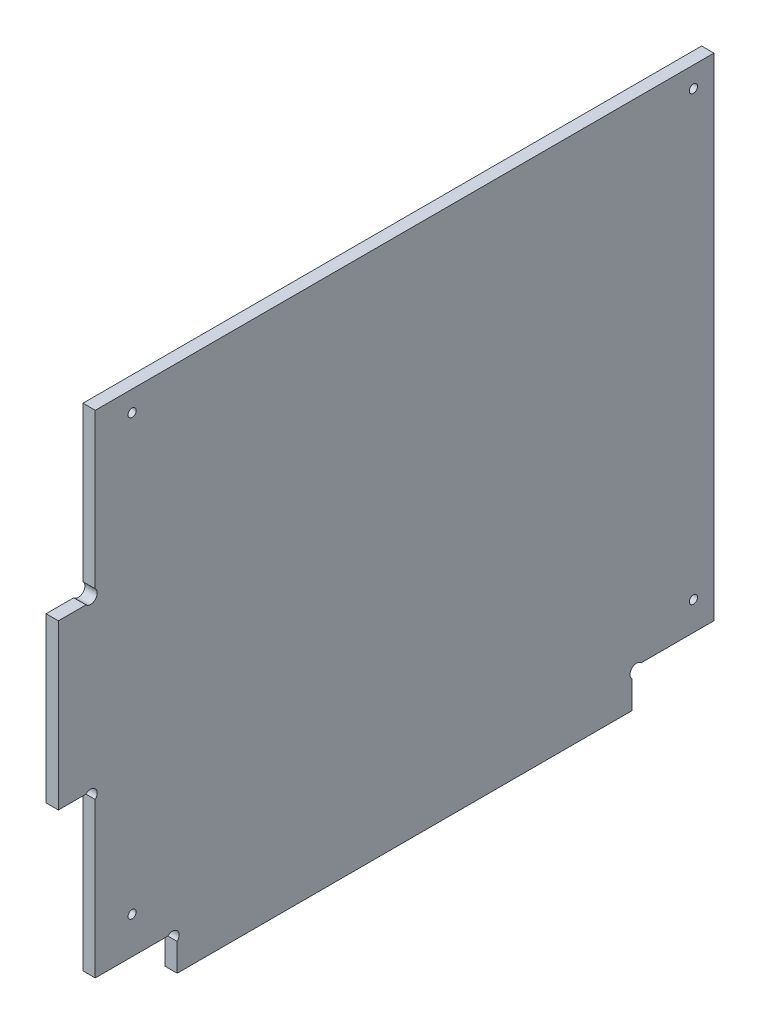
ISO-10303-21;
HEADER;
FILE_DESCRIPTION(('STEP AP214'),'2;1');
FILE_NAME('part.step','',(''),(''),'','','');
FILE_SCHEMA(('AUTOMOTIVE_DESIGN { 1 0 10303 214 1 1 1 1 }'));
ENDSEC;
DATA;
#1=APPLICATION_CONTEXT('core data for automotive mechanical design processes');
#2=APPLICATION_PROTOCOL_DEFINITION('international standard','automotive_design',2000,#1);
#3=PRODUCT_CONTEXT('',#1,'mechanical');
#4=PRODUCT('Part','Part','',(#3));
#5=PRODUCT_RELATED_PRODUCT_CATEGORY('part','',(#4));
#6=PRODUCT_DEFINITION_FORMATION('','',#4);
#7=PRODUCT_DEFINITION_CONTEXT('part definition',#1,'design');
#8=PRODUCT_DEFINITION('design','',#6,#7);
#9=PRODUCT_DEFINITION_SHAPE('','',#8);
#10=(LENGTH_UNIT() NAMED_UNIT(*) SI_UNIT(.MILLI.,.METRE.));
#11=(NAMED_UNIT(*) PLANE_ANGLE_UNIT() SI_UNIT($,.RADIAN.));
#12=(NAMED_UNIT(*) SI_UNIT($,.STERADIAN.) SOLID_ANGLE_UNIT());
#13=UNCERTAINTY_MEASURE_WITH_UNIT(LENGTH_MEASURE(1.E-05),#10,'distance_accuracy_value','');
#14=(GEOMETRIC_REPRESENTATION_CONTEXT(3) GLOBAL_UNCERTAINTY_ASSIGNED_CONTEXT((#13)) GLOBAL_UNIT_ASSIGNED_CONTEXT((#10,
#11,#12)) REPRESENTATION_CONTEXT('',''));
#15=CARTESIAN_POINT('',(0.,0.,0.));
#16=DIRECTION('',(0.,0.,1.));
#17=DIRECTION('',(1.,0.,0.));
#18=AXIS2_PLACEMENT_3D('',#15,#16,#17);
#19=CARTESIAN_POINT('',(3.,7.86862915010151,-141.131370849899));
#20=DIRECTION('',(-1.,0.,0.));
#21=DIRECTION('',(0.,0.,1.));
#22=AXIS2_PLACEMENT_3D('',#19,#20,#21);
#23=CYLINDRICAL_SURFACE('',#22,1.59999999999999);
#24=CARTESIAN_POINT('',(0.,7.86862915010151,-141.131370849899));
#25=DIRECTION('',(-1.,0.,0.));
#26=DIRECTION('',(0.,0.,-1.));
#27=AXIS2_PLACEMENT_3D('',#24,#25,#26);
#28=CIRCLE('',#27,1.59999999999999);
#29=CARTESIAN_POINT('',(0.,6.73725830020303,-140.));
#30=VERTEX_POINT('',#29);
#31=CARTESIAN_POINT('',(0.,9.,-142.262741699797));
#32=VERTEX_POINT('',#31);
#33=EDGE_CURVE('E179',#30,#32,#28,.T.);
#34=ORIENTED_EDGE('',*,*,#33,.T.);
#35=DIRECTION('',(-1.,0.,0.));
#36=VECTOR('',#35,1.);
#37=CARTESIAN_POINT('',(3.,9.,-142.262741699797));
#38=LINE('',#37,#36);
#39=CARTESIAN_POINT('',(3.,9.,-142.262741699797));
#40=VERTEX_POINT('',#39);
#41=EDGE_CURVE('E11',#40,#32,#38,.T.);
#42=ORIENTED_EDGE('',*,*,#41,.F.);
#43=CARTESIAN_POINT('',(3.,7.86862915010151,-141.131370849899));
#44=DIRECTION('',(-1.,0.,0.));
#45=DIRECTION('',(0.,0.,-1.));
#46=AXIS2_PLACEMENT_3D('',#43,#44,#45);
#47=CIRCLE('',#46,1.59999999999999);
#48=CARTESIAN_POINT('',(3.,6.73725830020303,-140.));
#49=VERTEX_POINT('',#48);
#50=EDGE_CURVE('E210',#49,#40,#47,.T.);
#51=ORIENTED_EDGE('',*,*,#50,.F.);
#52=DIRECTION('',(-1.,0.,0.));
#53=VECTOR('',#52,1.);
#54=CARTESIAN_POINT('',(3.,6.73725830020303,-140.));
#55=LINE('',#54,#53);
#56=EDGE_CURVE('E175',#49,#30,#55,.T.);
#57=ORIENTED_EDGE('',*,*,#56,.T.);
#58=EDGE_LOOP('',(#34,#42,#51,#57));
#59=FACE_BOUND('',#58,.T.);
#60=ADVANCED_FACE('F35',(#59),#23,.F.);
#61=CARTESIAN_POINT('',(3.,8.99999999999999,-160.));
#62=DIRECTION('',(0.,1.,0.));
#63=DIRECTION('',(0.,0.,1.));
#64=AXIS2_PLACEMENT_3D('',#61,#62,#63);
#65=PLANE('',#64);
#66=DIRECTION('',(0.,0.,-1.));
#67=VECTOR('',#66,1.);
#68=CARTESIAN_POINT('',(0.,8.99999999999999,-160.));
#69=LINE('',#68,#67);
#70=CARTESIAN_POINT('',(0.,8.99999999999999,-160.));
#71=VERTEX_POINT('',#70);
#72=EDGE_CURVE('E182',#32,#71,#69,.T.);
#73=ORIENTED_EDGE('',*,*,#72,.T.);
#74=DIRECTION('',(-1.,0.,0.));
#75=VECTOR('',#74,1.);
#76=CARTESIAN_POINT('',(3.,8.99999999999999,-160.));
#77=LINE('',#76,#75);
#78=CARTESIAN_POINT('',(3.,8.99999999999999,-160.));
#79=VERTEX_POINT('',#78);
#80=EDGE_CURVE('E43',#79,#71,#77,.T.);
#81=ORIENTED_EDGE('',*,*,#80,.F.);
#82=DIRECTION('',(0.,0.,-1.));
#83=VECTOR('',#82,1.);
#84=CARTESIAN_POINT('',(3.,8.99999999999999,-160.));
#85=LINE('',#84,#83);
#86=EDGE_CURVE('E118',#40,#79,#85,.T.);
#87=ORIENTED_EDGE('',*,*,#86,.F.);
#88=ORIENTED_EDGE('',*,*,#41,.T.);
#89=EDGE_LOOP('',(#73,#81,#87,#88));
#90=FACE_BOUND('',#89,.T.);
#91=ADVANCED_FACE('F309',(#90),#65,.F.);
#92=CARTESIAN_POINT('',(3.,129.,-160.));
#93=DIRECTION('',(0.,0.,1.));
#94=DIRECTION('',(0.,-1.,0.));
#95=AXIS2_PLACEMENT_3D('',#92,#93,#94);
#96=PLANE('',#95);
#97=DIRECTION('',(0.,1.,0.));
#98=VECTOR('',#97,1.);
#99=CARTESIAN_POINT('',(0.,129.,-160.));
#100=LINE('',#99,#98);
#101=CARTESIAN_POINT('',(0.,129.,-160.));
#102=VERTEX_POINT('',#101);
#103=EDGE_CURVE('E185',#71,#102,#100,.T.);
#104=ORIENTED_EDGE('',*,*,#103,.T.);
#105=DIRECTION('',(-1.,0.,0.));
#106=VECTOR('',#105,1.);
#107=CARTESIAN_POINT('',(3.,129.,-160.));
#108=LINE('',#107,#106);
#109=CARTESIAN_POINT('',(3.,129.,-160.));
#110=VERTEX_POINT('',#109);
#111=EDGE_CURVE('E241',#110,#102,#108,.T.);
#112=ORIENTED_EDGE('',*,*,#111,.F.);
#113=DIRECTION('',(0.,1.,0.));
#114=VECTOR('',#113,1.);
#115=CARTESIAN_POINT('',(3.,129.,-160.));
#116=LINE('',#115,#114);
#117=EDGE_CURVE('E249',#79,#110,#116,.T.);
#118=ORIENTED_EDGE('',*,*,#117,.F.);
#119=ORIENTED_EDGE('',*,*,#80,.T.);
#120=EDGE_LOOP('',(#104,#112,#118,#119));
#121=FACE_BOUND('',#120,.T.);
#122=ADVANCED_FACE('F247',(#121),#96,.F.);
#123=CARTESIAN_POINT('',(3.,129.,-8.99999999999997));
#124=DIRECTION('',(0.,-1.,0.));
#125=DIRECTION('',(0.,0.,-1.));
#126=AXIS2_PLACEMENT_3D('',#123,#124,#125);
#127=PLANE('',#126);
#128=DIRECTION('',(0.,0.,1.));
#129=VECTOR('',#128,1.);
#130=CARTESIAN_POINT('',(0.,129.,-8.99999999999997));
#131=LINE('',#130,#129);
#132=CARTESIAN_POINT('',(0.,129.,-8.99999999999997));
#133=VERTEX_POINT('',#132);
#134=EDGE_CURVE('E187',#102,#133,#131,.T.);
#135=ORIENTED_EDGE('',*,*,#134,.T.);
#136=DIRECTION('',(-1.,0.,0.));
#137=VECTOR('',#136,1.);
#138=CARTESIAN_POINT('',(3.,129.,-8.99999999999997));
#139=LINE('',#138,#137);
#140=CARTESIAN_POINT('',(3.,129.,-8.99999999999997));
#141=VERTEX_POINT('',#140);
#142=EDGE_CURVE('E238',#141,#133,#139,.T.);
#143=ORIENTED_EDGE('',*,*,#142,.F.);
#144=DIRECTION('',(0.,0.,1.));
#145=VECTOR('',#144,1.);
#146=CARTESIAN_POINT('',(3.,129.,-8.99999999999997));
#147=LINE('',#146,#145);
#148=EDGE_CURVE('E267',#110,#141,#147,.T.);
#149=ORIENTED_EDGE('',*,*,#148,.F.);
#150=ORIENTED_EDGE('',*,*,#111,.T.);
#151=EDGE_LOOP('',(#135,#143,#149,#150));
#152=FACE_BOUND('',#151,.T.);
#153=ADVANCED_FACE('F258',(#152),#127,.F.);
#154=CARTESIAN_POINT('',(3.,91.2627416997969,-8.99999999999998));
#155=DIRECTION('',(0.,0.,-1.));
#156=DIRECTION('',(0.,1.,0.));
#157=AXIS2_PLACEMENT_3D('',#154,#155,#156);
#158=PLANE('',#157);
#159=DIRECTION('',(0.,-1.,0.));
#160=VECTOR('',#159,1.);
#161=CARTESIAN_POINT('',(0.,91.2627416997969,-8.99999999999998));
#162=LINE('',#161,#160);
#163=CARTESIAN_POINT('',(0.,91.2627416997969,-8.99999999999998));
#164=VERTEX_POINT('',#163);
#165=EDGE_CURVE('E189',#133,#164,#162,.T.);
#166=ORIENTED_EDGE('',*,*,#165,.T.);
#167=DIRECTION('',(-1.,0.,0.));
#168=VECTOR('',#167,1.);
#169=CARTESIAN_POINT('',(3.,91.2627416997969,-8.99999999999998));
#170=LINE('',#169,#168);
#171=CARTESIAN_POINT('',(3.,91.2627416997969,-8.99999999999998));
#172=VERTEX_POINT('',#171);
#173=EDGE_CURVE('E235',#172,#164,#170,.T.);
#174=ORIENTED_EDGE('',*,*,#173,.F.);
#175=DIRECTION('',(0.,-1.,0.));
#176=VECTOR('',#175,1.);
#177=CARTESIAN_POINT('',(3.,91.2627416997969,-8.99999999999998));
#178=LINE('',#177,#176);
#179=EDGE_CURVE('E264',#141,#172,#178,.T.);
#180=ORIENTED_EDGE('',*,*,#179,.F.);
#181=ORIENTED_EDGE('',*,*,#142,.T.);
#182=EDGE_LOOP('',(#166,#174,#180,#181));
#183=FACE_BOUND('',#182,.T.);
#184=ADVANCED_FACE('F262',(#183),#158,.F.);
#185=CARTESIAN_POINT('',(3.,90.1313708498985,-7.86862915010151));
#186=DIRECTION('',(-1.,0.,0.));
#187=DIRECTION('',(0.,0.,1.));
#188=AXIS2_PLACEMENT_3D('',#185,#186,#187);
#189=CYLINDRICAL_SURFACE('',#188,1.6);
#190=CARTESIAN_POINT('',(0.,90.1313708498985,-7.86862915010151));
#191=DIRECTION('',(-1.,0.,0.));
#192=DIRECTION('',(0.,0.,1.));
#193=AXIS2_PLACEMENT_3D('',#190,#191,#192);
#194=CIRCLE('',#193,1.6);
#195=CARTESIAN_POINT('',(0.,89.,-6.73725830020303));
#196=VERTEX_POINT('',#195);
#197=EDGE_CURVE('E191',#164,#196,#194,.T.);
#198=ORIENTED_EDGE('',*,*,#197,.T.);
#199=DIRECTION('',(-1.,0.,0.));
#200=VECTOR('',#199,1.);
#201=CARTESIAN_POINT('',(3.,89.,-6.73725830020303));
#202=LINE('',#201,#200);
#203=CARTESIAN_POINT('',(3.,89.,-6.73725830020303));
#204=VERTEX_POINT('',#203);
#205=EDGE_CURVE('E232',#204,#196,#202,.T.);
#206=ORIENTED_EDGE('',*,*,#205,.F.);
#207=CARTESIAN_POINT('',(3.,90.1313708498985,-7.86862915010151));
#208=DIRECTION('',(-1.,0.,0.));
#209=DIRECTION('',(0.,0.,1.));
#210=AXIS2_PLACEMENT_3D('',#207,#208,#209);
#211=CIRCLE('',#210,1.6);
#212=EDGE_CURVE('E266',#172,#204,#211,.T.);
#213=ORIENTED_EDGE('',*,*,#212,.F.);
#214=ORIENTED_EDGE('',*,*,#173,.T.);
#215=EDGE_LOOP('',(#198,#206,#213,#214));
#216=FACE_BOUND('',#215,.T.);
#217=ADVANCED_FACE('F322',(#216),#189,.F.);
#218=CARTESIAN_POINT('',(3.,89.,0.));
#219=DIRECTION('',(0.,-1.,0.));
#220=DIRECTION('',(0.,0.,-1.));
#221=AXIS2_PLACEMENT_3D('',#218,#219,#220);
#222=PLANE('',#221);
#223=DIRECTION('',(0.,0.,1.));
#224=VECTOR('',#223,1.);
#225=CARTESIAN_POINT('',(0.,89.,0.));
#226=LINE('',#225,#224);
#227=CARTESIAN_POINT('',(0.,89.,0.));
#228=VERTEX_POINT('',#227);
#229=EDGE_CURVE('E193',#196,#228,#226,.T.);
#230=ORIENTED_EDGE('',*,*,#229,.T.);
#231=DIRECTION('',(-1.,0.,0.));
#232=VECTOR('',#231,1.);
#233=CARTESIAN_POINT('',(3.,89.,0.));
#234=LINE('',#233,#232);
#235=CARTESIAN_POINT('',(3.,89.,0.));
#236=VERTEX_POINT('',#235);
#237=EDGE_CURVE('E229',#236,#228,#234,.T.);
#238=ORIENTED_EDGE('',*,*,#237,.F.);
#239=DIRECTION('',(0.,0.,1.));
#240=VECTOR('',#239,1.);
#241=CARTESIAN_POINT('',(3.,89.,0.));
#242=LINE('',#241,#240);
#243=EDGE_CURVE('E269',#204,#236,#242,.T.);
#244=ORIENTED_EDGE('',*,*,#243,.F.);
#245=ORIENTED_EDGE('',*,*,#205,.T.);
#246=EDGE_LOOP('',(#230,#238,#244,#245));
#247=FACE_BOUND('',#246,.T.);
#248=ADVANCED_FACE('F325',(#247),#222,.F.);
#249=CARTESIAN_POINT('',(3.,49.,0.));
#250=DIRECTION('',(0.,0.,-1.));
#251=DIRECTION('',(-1.,0.,0.));
#252=AXIS2_PLACEMENT_3D('',#249,#250,#251);
#253=PLANE('',#252);
#254=DIRECTION('',(0.,-1.,0.));
#255=VECTOR('',#254,1.);
#256=CARTESIAN_POINT('',(0.,49.,0.));
#257=LINE('',#256,#255);
#258=CARTESIAN_POINT('',(0.,49.,0.));
#259=VERTEX_POINT('',#258);
#260=EDGE_CURVE('E195',#228,#259,#257,.T.);
#261=ORIENTED_EDGE('',*,*,#260,.T.);
#262=DIRECTION('',(-1.,0.,0.));
#263=VECTOR('',#262,1.);
#264=CARTESIAN_POINT('',(3.,49.,0.));
#265=LINE('',#264,#263);
#266=CARTESIAN_POINT('',(3.,49.,0.));
#267=VERTEX_POINT('',#266);
#268=EDGE_CURVE('E226',#267,#259,#265,.T.);
#269=ORIENTED_EDGE('',*,*,#268,.F.);
#270=DIRECTION('',(0.,-1.,0.));
#271=VECTOR('',#270,1.);
#272=CARTESIAN_POINT('',(3.,49.,0.));
#273=LINE('',#272,#271);
#274=EDGE_CURVE('E275',#236,#267,#273,.T.);
#275=ORIENTED_EDGE('',*,*,#274,.F.);
#276=ORIENTED_EDGE('',*,*,#237,.T.);
#277=EDGE_LOOP('',(#261,#269,#275,#276));
#278=FACE_BOUND('',#277,.T.);
#279=ADVANCED_FACE('F329',(#278),#253,.F.);
#280=CARTESIAN_POINT('',(3.,49.,0.));
#281=DIRECTION('',(0.,1.,0.));
#282=DIRECTION('',(0.,0.,1.));
#283=AXIS2_PLACEMENT_3D('',#280,#281,#282);
#284=PLANE('',#283);
#285=DIRECTION('',(0.,0.,-1.));
#286=VECTOR('',#285,1.);
#287=CARTESIAN_POINT('',(0.,49.,0.));
#288=LINE('',#287,#286);
#289=CARTESIAN_POINT('',(0.,49.,-6.73725830020302));
#290=VERTEX_POINT('',#289);
#291=EDGE_CURVE('E197',#259,#290,#288,.T.);
#292=ORIENTED_EDGE('',*,*,#291,.T.);
#293=DIRECTION('',(-1.,0.,0.));
#294=VECTOR('',#293,1.);
#295=CARTESIAN_POINT('',(3.,49.,-6.73725830020302));
#296=LINE('',#295,#294);
#297=CARTESIAN_POINT('',(3.,49.,-6.73725830020302));
#298=VERTEX_POINT('',#297);
#299=EDGE_CURVE('E223',#298,#290,#296,.T.);
#300=ORIENTED_EDGE('',*,*,#299,.F.);
#301=DIRECTION('',(0.,0.,-1.));
#302=VECTOR('',#301,1.);
#303=CARTESIAN_POINT('',(3.,49.,0.));
#304=LINE('',#303,#302);
#305=EDGE_CURVE('E277',#267,#298,#304,.T.);
#306=ORIENTED_EDGE('',*,*,#305,.F.);
#307=ORIENTED_EDGE('',*,*,#268,.T.);
#308=EDGE_LOOP('',(#292,#300,#306,#307));
#309=FACE_BOUND('',#308,.T.);
#310=ADVANCED_FACE('F333',(#309),#284,.F.);
#311=CARTESIAN_POINT('',(3.,47.8686291501015,-7.86862915010151));
#312=DIRECTION('',(-1.,0.,0.));
#313=DIRECTION('',(0.,0.,1.));
#314=AXIS2_PLACEMENT_3D('',#311,#312,#313);
#315=CYLINDRICAL_SURFACE('',#314,1.6);
#316=CARTESIAN_POINT('',(0.,47.8686291501015,-7.86862915010151));
#317=DIRECTION('',(-1.,0.,0.));
#318=DIRECTION('',(0.,0.,-1.));
#319=AXIS2_PLACEMENT_3D('',#316,#317,#318);
#320=CIRCLE('',#319,1.6);
#321=CARTESIAN_POINT('',(0.,46.7372583002031,-8.99999999999999));
#322=VERTEX_POINT('',#321);
#323=EDGE_CURVE('E199',#290,#322,#320,.T.);
#324=ORIENTED_EDGE('',*,*,#323,.T.);
#325=DIRECTION('',(-1.,0.,0.));
#326=VECTOR('',#325,1.);
#327=CARTESIAN_POINT('',(3.,46.7372583002031,-8.99999999999999));
#328=LINE('',#327,#326);
#329=CARTESIAN_POINT('',(3.,46.7372583002031,-8.99999999999999));
#330=VERTEX_POINT('',#329);
#331=EDGE_CURVE('E220',#330,#322,#328,.T.);
#332=ORIENTED_EDGE('',*,*,#331,.F.);
#333=CARTESIAN_POINT('',(3.,47.8686291501015,-7.86862915010151));
#334=DIRECTION('',(-1.,0.,0.));
#335=DIRECTION('',(0.,0.,-1.));
#336=AXIS2_PLACEMENT_3D('',#333,#334,#335);
#337=CIRCLE('',#336,1.6);
#338=EDGE_CURVE('E279',#298,#330,#337,.T.);
#339=ORIENTED_EDGE('',*,*,#338,.F.);
#340=ORIENTED_EDGE('',*,*,#299,.T.);
#341=EDGE_LOOP('',(#324,#332,#339,#340));
#342=FACE_BOUND('',#341,.T.);
#343=ADVANCED_FACE('F337',(#342),#315,.F.);
#344=CARTESIAN_POINT('',(3.,8.99999999999998,-9.));
#345=DIRECTION('',(0.,0.,-1.));
#346=DIRECTION('',(0.,1.,0.));
#347=AXIS2_PLACEMENT_3D('',#344,#345,#346);
#348=PLANE('',#347);
#349=DIRECTION('',(0.,-1.,0.));
#350=VECTOR('',#349,1.);
#351=CARTESIAN_POINT('',(0.,8.99999999999998,-9.));
#352=LINE('',#351,#350);
#353=CARTESIAN_POINT('',(0.,8.99999999999998,-9.));
#354=VERTEX_POINT('',#353);
#355=EDGE_CURVE('E201',#322,#354,#352,.T.);
#356=ORIENTED_EDGE('',*,*,#355,.T.);
#357=DIRECTION('',(-1.,0.,0.));
#358=VECTOR('',#357,1.);
#359=CARTESIAN_POINT('',(3.,8.99999999999998,-9.));
#360=LINE('',#359,#358);
#361=CARTESIAN_POINT('',(3.,8.99999999999998,-9.));
#362=VERTEX_POINT('',#361);
#363=EDGE_CURVE('E217',#362,#354,#360,.T.);
#364=ORIENTED_EDGE('',*,*,#363,.F.);
#365=DIRECTION('',(0.,-1.,0.));
#366=VECTOR('',#365,1.);
#367=CARTESIAN_POINT('',(3.,8.99999999999998,-9.));
#368=LINE('',#367,#366);
#369=EDGE_CURVE('E281',#330,#362,#368,.T.);
#370=ORIENTED_EDGE('',*,*,#369,.F.);
#371=ORIENTED_EDGE('',*,*,#331,.T.);
#372=EDGE_LOOP('',(#356,#364,#370,#371));
#373=FACE_BOUND('',#372,.T.);
#374=ADVANCED_FACE('F341',(#373),#348,.F.);
#375=CARTESIAN_POINT('',(3.,8.99999999999998,-26.737258300203));
#376=DIRECTION('',(0.,1.,0.));
#377=DIRECTION('',(0.,0.,1.));
#378=AXIS2_PLACEMENT_3D('',#375,#376,#377);
#379=PLANE('',#378);
#380=DIRECTION('',(0.,0.,-1.));
#381=VECTOR('',#380,1.);
#382=CARTESIAN_POINT('',(0.,8.99999999999998,-26.737258300203));
#383=LINE('',#382,#381);
#384=CARTESIAN_POINT('',(0.,8.99999999999998,-26.737258300203));
#385=VERTEX_POINT('',#384);
#386=EDGE_CURVE('E203',#354,#385,#383,.T.);
#387=ORIENTED_EDGE('',*,*,#386,.T.);
#388=DIRECTION('',(-1.,0.,0.));
#389=VECTOR('',#388,1.);
#390=CARTESIAN_POINT('',(3.,8.99999999999998,-26.737258300203));
#391=LINE('',#390,#389);
#392=CARTESIAN_POINT('',(3.,8.99999999999998,-26.737258300203));
#393=VERTEX_POINT('',#392);
#394=EDGE_CURVE('E214',#393,#385,#391,.T.);
#395=ORIENTED_EDGE('',*,*,#394,.F.);
#396=DIRECTION('',(0.,0.,-1.));
#397=VECTOR('',#396,1.);
#398=CARTESIAN_POINT('',(3.,8.99999999999998,-26.737258300203));
#399=LINE('',#398,#397);
#400=EDGE_CURVE('E283',#362,#393,#399,.T.);
#401=ORIENTED_EDGE('',*,*,#400,.F.);
#402=ORIENTED_EDGE('',*,*,#363,.T.);
#403=EDGE_LOOP('',(#387,#395,#401,#402));
#404=FACE_BOUND('',#403,.T.);
#405=ADVANCED_FACE('F289',(#404),#379,.F.);
#406=CARTESIAN_POINT('',(3.,7.8686291501015,-27.8686291501015));
#407=DIRECTION('',(-1.,0.,0.));
#408=DIRECTION('',(0.,0.,1.));
#409=AXIS2_PLACEMENT_3D('',#406,#407,#408);
#410=CYLINDRICAL_SURFACE('',#409,1.6);
#411=CARTESIAN_POINT('',(0.,7.8686291501015,-27.8686291501015));
#412=DIRECTION('',(-1.,0.,0.));
#413=DIRECTION('',(0.,0.,1.));
#414=AXIS2_PLACEMENT_3D('',#411,#412,#413);
#415=CIRCLE('',#414,1.6);
#416=CARTESIAN_POINT('',(0.,6.73725830020306,-29.));
#417=VERTEX_POINT('',#416);
#418=EDGE_CURVE('E205',#385,#417,#415,.T.);
#419=ORIENTED_EDGE('',*,*,#418,.T.);
#420=DIRECTION('',(-1.,0.,0.));
#421=VECTOR('',#420,1.);
#422=CARTESIAN_POINT('',(3.,6.73725830020306,-29.));
#423=LINE('',#422,#421);
#424=CARTESIAN_POINT('',(3.,6.73725830020306,-29.));
#425=VERTEX_POINT('',#424);
#426=EDGE_CURVE('E170',#425,#417,#423,.T.);
#427=ORIENTED_EDGE('',*,*,#426,.F.);
#428=CARTESIAN_POINT('',(3.,7.8686291501015,-27.8686291501015));
#429=DIRECTION('',(-1.,0.,0.));
#430=DIRECTION('',(0.,0.,1.));
#431=AXIS2_PLACEMENT_3D('',#428,#429,#430);
#432=CIRCLE('',#431,1.6);
#433=EDGE_CURVE('E161',#393,#425,#432,.T.);
#434=ORIENTED_EDGE('',*,*,#433,.F.);
#435=ORIENTED_EDGE('',*,*,#394,.T.);
#436=EDGE_LOOP('',(#419,#427,#434,#435));
#437=FACE_BOUND('',#436,.T.);
#438=ADVANCED_FACE('F293',(#437),#410,.F.);
#439=CARTESIAN_POINT('',(3.,6.73725830020306,-29.));
#440=DIRECTION('',(0.,0.,-1.));
#441=DIRECTION('',(0.,1.,0.));
#442=AXIS2_PLACEMENT_3D('',#439,#440,#441);
#443=PLANE('',#442);
#444=DIRECTION('',(0.,-1.,0.));
#445=VECTOR('',#444,1.);
#446=CARTESIAN_POINT('',(0.,6.73725830020306,-29.));
#447=LINE('',#446,#445);
#448=CARTESIAN_POINT('',(0.,0.,-29.));
#449=VERTEX_POINT('',#448);
#450=EDGE_CURVE('E169',#417,#449,#447,.T.);
#451=ORIENTED_EDGE('',*,*,#450,.T.);
#452=DIRECTION('',(-1.,0.,0.));
#453=VECTOR('',#452,1.);
#454=CARTESIAN_POINT('',(3.,0.,-29.));
#455=LINE('',#454,#453);
#456=CARTESIAN_POINT('',(3.,0.,-29.));
#457=VERTEX_POINT('',#456);
#458=EDGE_CURVE('E166',#457,#449,#455,.T.);
#459=ORIENTED_EDGE('',*,*,#458,.F.);
#460=DIRECTION('',(0.,-1.,0.));
#461=VECTOR('',#460,1.);
#462=CARTESIAN_POINT('',(3.,6.73725830020306,-29.));
#463=LINE('',#462,#461);
#464=EDGE_CURVE('E155',#425,#457,#463,.T.);
#465=ORIENTED_EDGE('',*,*,#464,.F.);
#466=ORIENTED_EDGE('',*,*,#426,.T.);
#467=EDGE_LOOP('',(#451,#459,#465,#466));
#468=FACE_BOUND('',#467,.T.);
#469=ADVANCED_FACE('F167',(#468),#443,.F.);
#470=CARTESIAN_POINT('',(3.,0.,-29.));
#471=DIRECTION('',(0.,1.,0.));
#472=DIRECTION('',(0.,0.,1.));
#473=AXIS2_PLACEMENT_3D('',#470,#471,#472);
#474=PLANE('',#473);
#475=DIRECTION('',(0.,0.,-1.));
#476=VECTOR('',#475,1.);
#477=CARTESIAN_POINT('',(0.,0.,-29.));
#478=LINE('',#477,#476);
#479=CARTESIAN_POINT('',(0.,0.,-140.));
#480=VERTEX_POINT('',#479);
#481=EDGE_CURVE('E104',#449,#480,#478,.T.);
#482=ORIENTED_EDGE('',*,*,#481,.T.);
#483=DIRECTION('',(-1.,0.,0.));
#484=VECTOR('',#483,1.);
#485=CARTESIAN_POINT('',(3.,0.,-140.));
#486=LINE('',#485,#484);
#487=CARTESIAN_POINT('',(3.,0.,-140.));
#488=VERTEX_POINT('',#487);
#489=EDGE_CURVE('E171',#488,#480,#486,.T.);
#490=ORIENTED_EDGE('',*,*,#489,.F.);
#491=DIRECTION('',(0.,0.,-1.));
#492=VECTOR('',#491,1.);
#493=CARTESIAN_POINT('',(3.,0.,-29.));
#494=LINE('',#493,#492);
#495=EDGE_CURVE('E159',#457,#488,#494,.T.);
#496=ORIENTED_EDGE('',*,*,#495,.F.);
#497=ORIENTED_EDGE('',*,*,#458,.T.);
#498=EDGE_LOOP('',(#482,#490,#496,#497));
#499=FACE_BOUND('',#498,.T.);
#500=ADVANCED_FACE('F173',(#499),#474,.F.);
#501=CARTESIAN_POINT('',(3.,6.73725830020303,-140.));
#502=DIRECTION('',(0.,0.,1.));
#503=DIRECTION('',(0.,-1.,0.));
#504=AXIS2_PLACEMENT_3D('',#501,#502,#503);
#505=PLANE('',#504);
#506=DIRECTION('',(0.,1.,0.));
#507=VECTOR('',#506,1.);
#508=CARTESIAN_POINT('',(0.,6.73725830020303,-140.));
#509=LINE('',#508,#507);
#510=EDGE_CURVE('E110',#480,#30,#509,.T.);
#511=ORIENTED_EDGE('',*,*,#510,.T.);
#512=ORIENTED_EDGE('',*,*,#56,.F.);
#513=DIRECTION('',(0.,1.,0.));
#514=VECTOR('',#513,1.);
#515=CARTESIAN_POINT('',(3.,6.73725830020303,-140.));
#516=LINE('',#515,#514);
#517=EDGE_CURVE('E51',#488,#49,#516,.T.);
#518=ORIENTED_EDGE('',*,*,#517,.F.);
#519=ORIENTED_EDGE('',*,*,#489,.T.);
#520=EDGE_LOOP('',(#511,#512,#518,#519));
#521=FACE_BOUND('',#520,.T.);
#522=ADVANCED_FACE('F297',(#521),#505,.F.);
#523=CARTESIAN_POINT('',(3.,7.86862915010151,-141.131370849899));
#524=DIRECTION('',(1.,0.,0.));
#525=DIRECTION('',(0.,0.,-1.));
#526=AXIS2_PLACEMENT_3D('',#523,#524,#525);
#527=PLANE('',#526);
#528=CARTESIAN_POINT('',(3.,124.,-155.));
#529=DIRECTION('',(1.,0.,0.));
#530=DIRECTION('',(0.,0.,-1.));
#531=AXIS2_PLACEMENT_3D('',#528,#529,#530);
#532=CIRCLE('',#531,0.999999999999998);
#533=CARTESIAN_POINT('',(3.,124.,-156.));
#534=VERTEX_POINT('',#533);
#535=EDGE_CURVE('E429',#534,#534,#532,.T.);
#536=ORIENTED_EDGE('',*,*,#535,.F.);
#537=EDGE_LOOP('',(#536));
#538=FACE_BOUND('',#537,.T.);
#539=CARTESIAN_POINT('',(3.,18.,-18.));
#540=DIRECTION('',(1.,0.,0.));
#541=DIRECTION('',(0.,0.,-1.));
#542=AXIS2_PLACEMENT_3D('',#539,#540,#541);
#543=CIRCLE('',#542,1.00000000000001);
#544=CARTESIAN_POINT('',(3.,18.,-19.));
#545=VERTEX_POINT('',#544);
#546=EDGE_CURVE('E435',#545,#545,#543,.T.);
#547=ORIENTED_EDGE('',*,*,#546,.F.);
#548=EDGE_LOOP('',(#547));
#549=FACE_BOUND('',#548,.T.);
#550=CARTESIAN_POINT('',(3.,16.,-155.));
#551=DIRECTION('',(1.,0.,0.));
#552=DIRECTION('',(0.,0.,-1.));
#553=AXIS2_PLACEMENT_3D('',#550,#551,#552);
#554=CIRCLE('',#553,0.999999999999998);
#555=CARTESIAN_POINT('',(3.,16.,-156.));
#556=VERTEX_POINT('',#555);
#557=EDGE_CURVE('E455',#556,#556,#554,.T.);
#558=ORIENTED_EDGE('',*,*,#557,.F.);
#559=EDGE_LOOP('',(#558));
#560=FACE_BOUND('',#559,.T.);
#561=CARTESIAN_POINT('',(3.,124.,-18.));
#562=DIRECTION('',(1.,0.,0.));
#563=DIRECTION('',(0.,0.,-1.));
#564=AXIS2_PLACEMENT_3D('',#561,#562,#563);
#565=CIRCLE('',#564,1.);
#566=CARTESIAN_POINT('',(3.,124.,-19.));
#567=VERTEX_POINT('',#566);
#568=EDGE_CURVE('E432',#567,#567,#565,.T.);
#569=ORIENTED_EDGE('',*,*,#568,.F.);
#570=EDGE_LOOP('',(#569));
#571=FACE_BOUND('',#570,.T.);
#572=ORIENTED_EDGE('',*,*,#50,.T.);
#573=ORIENTED_EDGE('',*,*,#86,.T.);
#574=ORIENTED_EDGE('',*,*,#117,.T.);
#575=ORIENTED_EDGE('',*,*,#148,.T.);
#576=ORIENTED_EDGE('',*,*,#179,.T.);
#577=ORIENTED_EDGE('',*,*,#212,.T.);
#578=ORIENTED_EDGE('',*,*,#243,.T.);
#579=ORIENTED_EDGE('',*,*,#274,.T.);
#580=ORIENTED_EDGE('',*,*,#305,.T.);
#581=ORIENTED_EDGE('',*,*,#338,.T.);
#582=ORIENTED_EDGE('',*,*,#369,.T.);
#583=ORIENTED_EDGE('',*,*,#400,.T.);
#584=ORIENTED_EDGE('',*,*,#433,.T.);
#585=ORIENTED_EDGE('',*,*,#464,.T.);
#586=ORIENTED_EDGE('',*,*,#495,.T.);
#587=ORIENTED_EDGE('',*,*,#517,.T.);
#588=EDGE_LOOP('',(#572,#573,#574,#575,#576,#577,#578,#579,#580,#581,#582,#583,#584,#585,#586,#587));
#589=FACE_BOUND('',#588,.T.);
#590=ADVANCED_FACE('F157',(#538,#549,#560,#571,#589),#527,.T.);
#591=CARTESIAN_POINT('',(0.,7.86862915010151,-141.131370849899));
#592=DIRECTION('',(1.,0.,0.));
#593=DIRECTION('',(0.,0.,-1.));
#594=AXIS2_PLACEMENT_3D('',#591,#592,#593);
#595=PLANE('',#594);
#596=CARTESIAN_POINT('',(0.,124.,-155.));
#597=DIRECTION('',(1.,0.,0.));
#598=DIRECTION('',(0.,0.,-1.));
#599=AXIS2_PLACEMENT_3D('',#596,#597,#598);
#600=CIRCLE('',#599,0.999999999999998);
#601=CARTESIAN_POINT('',(0.,124.,-156.));
#602=VERTEX_POINT('',#601);
#603=EDGE_CURVE('E426',#602,#602,#600,.T.);
#604=ORIENTED_EDGE('',*,*,#603,.T.);
#605=EDGE_LOOP('',(#604));
#606=FACE_BOUND('',#605,.T.);
#607=CARTESIAN_POINT('',(0.,18.,-18.));
#608=DIRECTION('',(1.,0.,0.));
#609=DIRECTION('',(0.,0.,-1.));
#610=AXIS2_PLACEMENT_3D('',#607,#608,#609);
#611=CIRCLE('',#610,1.00000000000001);
#612=CARTESIAN_POINT('',(0.,18.,-19.));
#613=VERTEX_POINT('',#612);
#614=EDGE_CURVE('E430',#613,#613,#611,.T.);
#615=ORIENTED_EDGE('',*,*,#614,.T.);
#616=EDGE_LOOP('',(#615));
#617=FACE_BOUND('',#616,.T.);
#618=CARTESIAN_POINT('',(0.,16.,-155.));
#619=DIRECTION('',(1.,0.,0.));
#620=DIRECTION('',(0.,0.,-1.));
#621=AXIS2_PLACEMENT_3D('',#618,#619,#620);
#622=CIRCLE('',#621,0.999999999999998);
#623=CARTESIAN_POINT('',(0.,16.,-156.));
#624=VERTEX_POINT('',#623);
#625=EDGE_CURVE('E441',#624,#624,#622,.T.);
#626=ORIENTED_EDGE('',*,*,#625,.T.);
#627=EDGE_LOOP('',(#626));
#628=FACE_BOUND('',#627,.T.);
#629=CARTESIAN_POINT('',(0.,124.,-18.));
#630=DIRECTION('',(1.,0.,0.));
#631=DIRECTION('',(0.,0.,-1.));
#632=AXIS2_PLACEMENT_3D('',#629,#630,#631);
#633=CIRCLE('',#632,1.);
#634=CARTESIAN_POINT('',(0.,124.,-19.));
#635=VERTEX_POINT('',#634);
#636=EDGE_CURVE('E183',#635,#635,#633,.T.);
#637=ORIENTED_EDGE('',*,*,#636,.T.);
#638=EDGE_LOOP('',(#637));
#639=FACE_BOUND('',#638,.T.);
#640=ORIENTED_EDGE('',*,*,#33,.F.);
#641=ORIENTED_EDGE('',*,*,#510,.F.);
#642=ORIENTED_EDGE('',*,*,#481,.F.);
#643=ORIENTED_EDGE('',*,*,#450,.F.);
#644=ORIENTED_EDGE('',*,*,#418,.F.);
#645=ORIENTED_EDGE('',*,*,#386,.F.);
#646=ORIENTED_EDGE('',*,*,#355,.F.);
#647=ORIENTED_EDGE('',*,*,#323,.F.);
#648=ORIENTED_EDGE('',*,*,#291,.F.);
#649=ORIENTED_EDGE('',*,*,#260,.F.);
#650=ORIENTED_EDGE('',*,*,#229,.F.);
#651=ORIENTED_EDGE('',*,*,#197,.F.);
#652=ORIENTED_EDGE('',*,*,#165,.F.);
#653=ORIENTED_EDGE('',*,*,#134,.F.);
#654=ORIENTED_EDGE('',*,*,#103,.F.);
#655=ORIENTED_EDGE('',*,*,#72,.F.);
#656=EDGE_LOOP('',(#640,#641,#642,#643,#644,#645,#646,#647,#648,#649,#650,#651,#652,#653,#654,#655));
#657=FACE_BOUND('',#656,.T.);
#658=ADVANCED_FACE('F253',(#606,#617,#628,#639,#657),#595,.F.);
#659=CARTESIAN_POINT('',(0.,124.,-18.));
#660=DIRECTION('',(1.,0.,0.));
#661=DIRECTION('',(0.,0.,-1.));
#662=AXIS2_PLACEMENT_3D('',#659,#660,#661);
#663=CYLINDRICAL_SURFACE('',#662,1.);
#664=ORIENTED_EDGE('',*,*,#636,.F.);
#665=EDGE_LOOP('',(#664));
#666=FACE_BOUND('',#665,.T.);
#667=ORIENTED_EDGE('',*,*,#568,.T.);
#668=EDGE_LOOP('',(#667));
#669=FACE_BOUND('',#668,.T.);
#670=ADVANCED_FACE('F380',(#666,#669),#663,.F.);
#671=CARTESIAN_POINT('',(0.,16.,-155.));
#672=DIRECTION('',(1.,0.,0.));
#673=DIRECTION('',(0.,0.,-1.));
#674=AXIS2_PLACEMENT_3D('',#671,#672,#673);
#675=CYLINDRICAL_SURFACE('',#674,0.999999999999998);
#676=ORIENTED_EDGE('',*,*,#625,.F.);
#677=EDGE_LOOP('',(#676));
#678=FACE_BOUND('',#677,.T.);
#679=ORIENTED_EDGE('',*,*,#557,.T.);
#680=EDGE_LOOP('',(#679));
#681=FACE_BOUND('',#680,.T.);
#682=ADVANCED_FACE('F389',(#678,#681),#675,.F.);
#683=CARTESIAN_POINT('',(0.,18.,-18.));
#684=DIRECTION('',(1.,0.,0.));
#685=DIRECTION('',(0.,0.,-1.));
#686=AXIS2_PLACEMENT_3D('',#683,#684,#685);
#687=CYLINDRICAL_SURFACE('',#686,1.00000000000001);
#688=ORIENTED_EDGE('',*,*,#614,.F.);
#689=EDGE_LOOP('',(#688));
#690=FACE_BOUND('',#689,.T.);
#691=ORIENTED_EDGE('',*,*,#546,.T.);
#692=EDGE_LOOP('',(#691));
#693=FACE_BOUND('',#692,.T.);
#694=ADVANCED_FACE('F399',(#690,#693),#687,.F.);
#695=CARTESIAN_POINT('',(0.,124.,-155.));
#696=DIRECTION('',(1.,0.,0.));
#697=DIRECTION('',(0.,0.,-1.));
#698=AXIS2_PLACEMENT_3D('',#695,#696,#697);
#699=CYLINDRICAL_SURFACE('',#698,0.999999999999998);
#700=ORIENTED_EDGE('',*,*,#603,.F.);
#701=EDGE_LOOP('',(#700));
#702=FACE_BOUND('',#701,.T.);
#703=ORIENTED_EDGE('',*,*,#535,.T.);
#704=EDGE_LOOP('',(#703));
#705=FACE_BOUND('',#704,.T.);
#706=ADVANCED_FACE('F409',(#702,#705),#699,.F.);
#707=CLOSED_SHELL('',(#60,#91,#122,#153,#184,#217,#248,#279,#310,#343,#374,#405,#438,#469,#500,
#522,#590,#658,#670,#682,#694,#706));
#708=MANIFOLD_SOLID_BREP('B2',#707);
#709=ADVANCED_BREP_SHAPE_REPRESENTATION('',(#18,#708),#14);
#710=SHAPE_DEFINITION_REPRESENTATION(#9,#709);
ENDSEC;
END-ISO-10303-21;
